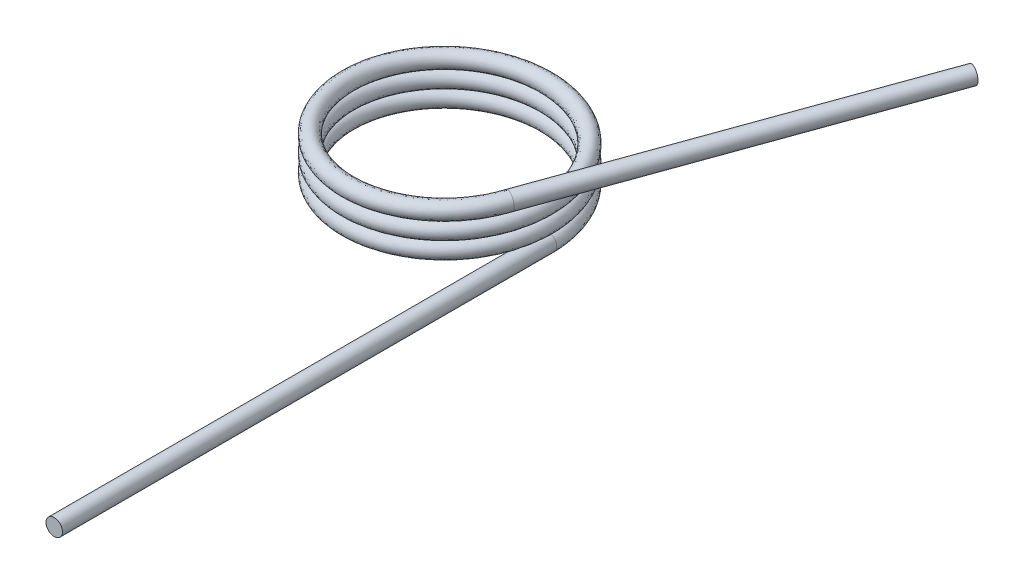
ISO-10303-21;
HEADER;
FILE_DESCRIPTION(('STEP AP214'),'2;1');
FILE_NAME('part.step','',(''),(''),'','','');
FILE_SCHEMA(('AUTOMOTIVE_DESIGN { 1 0 10303 214 1 1 1 1 }'));
ENDSEC;
DATA;
#1=APPLICATION_CONTEXT('core data for automotive mechanical design processes');
#2=APPLICATION_PROTOCOL_DEFINITION('international standard','automotive_design',2000,#1);
#3=PRODUCT_CONTEXT('',#1,'mechanical');
#4=PRODUCT('Part','Part','',(#3));
#5=PRODUCT_RELATED_PRODUCT_CATEGORY('part','',(#4));
#6=PRODUCT_DEFINITION_FORMATION('','',#4);
#7=PRODUCT_DEFINITION_CONTEXT('part definition',#1,'design');
#8=PRODUCT_DEFINITION('design','',#6,#7);
#9=PRODUCT_DEFINITION_SHAPE('','',#8);
#10=(LENGTH_UNIT() NAMED_UNIT(*) SI_UNIT(.MILLI.,.METRE.));
#11=(NAMED_UNIT(*) PLANE_ANGLE_UNIT() SI_UNIT($,.RADIAN.));
#12=(NAMED_UNIT(*) SI_UNIT($,.STERADIAN.) SOLID_ANGLE_UNIT());
#13=UNCERTAINTY_MEASURE_WITH_UNIT(LENGTH_MEASURE(1.E-05),#10,'distance_accuracy_value','');
#14=(GEOMETRIC_REPRESENTATION_CONTEXT(3) GLOBAL_UNCERTAINTY_ASSIGNED_CONTEXT((#13)) GLOBAL_UNIT_ASSIGNED_CONTEXT((#10,
#11,#12)) REPRESENTATION_CONTEXT('',''));
#15=CARTESIAN_POINT('',(0.,0.,0.));
#16=DIRECTION('',(0.,0.,1.));
#17=DIRECTION('',(1.,0.,0.));
#18=AXIS2_PLACEMENT_3D('',#15,#16,#17);
#19=CARTESIAN_POINT('',(3.25,0.,0.));
#20=CARTESIAN_POINT('',(3.25,0.0424448217317487,-1.87638837486628));
#21=CARTESIAN_POINT('',(1.625,0.0848896434634974,-2.81458256229942));
#22=CARTESIAN_POINT('',(0.,0.127334465195246,-3.75277674973257));
#23=CARTESIAN_POINT('',(-1.625,0.169779286926995,-2.81458256229943));
#24=CARTESIAN_POINT('',(-3.25,0.212224108658743,-1.87638837486628));
#25=CARTESIAN_POINT('',(-3.25,0.254668930390492,0.));
#26=CARTESIAN_POINT('',(-3.25,0.297113752122241,1.87638837486628));
#27=CARTESIAN_POINT('',(-1.625,0.339558573853989,2.81458256229942));
#28=CARTESIAN_POINT('',(0.,0.382003395585738,3.75277674973257));
#29=CARTESIAN_POINT('',(1.625,0.424448217317487,2.81458256229943));
#30=CARTESIAN_POINT('',(3.25,0.466893039049236,1.87638837486629));
#31=CARTESIAN_POINT('',(3.25,0.509337860780984,0.));
#32=CARTESIAN_POINT('',(3.25,0.551782682512733,-1.87638837486628));
#33=CARTESIAN_POINT('',(1.625,0.594227504244482,-2.81458256229942));
#34=CARTESIAN_POINT('',(0.,0.63667232597623,-3.75277674973257));
#35=CARTESIAN_POINT('',(-1.625,0.679117147707979,-2.81458256229943));
#36=CARTESIAN_POINT('',(-3.25,0.721561969439728,-1.87638837486628));
#37=CARTESIAN_POINT('',(-3.25,0.764006791171476,0.));
#38=CARTESIAN_POINT('',(-3.25,0.806451612903225,1.87638837486628));
#39=CARTESIAN_POINT('',(-1.625,0.848896434634974,2.81458256229942));
#40=CARTESIAN_POINT('',(0.,0.891341256366722,3.75277674973257));
#41=CARTESIAN_POINT('',(1.625,0.933786078098471,2.81458256229943));
#42=CARTESIAN_POINT('',(3.25,0.97623089983022,1.87638837486629));
#43=CARTESIAN_POINT('',(3.25,1.01867572156197,0.));
#44=CARTESIAN_POINT('',(3.25,1.06112054329372,-1.87638837486628));
#45=CARTESIAN_POINT('',(1.625,1.10356536502547,-2.81458256229942));
#46=CARTESIAN_POINT('',(0.,1.14601018675721,-3.75277674973257));
#47=CARTESIAN_POINT('',(-1.625,1.18845500848896,-2.81458256229943));
#48=CARTESIAN_POINT('',(-3.25,1.23089983022071,-1.87638837486628));
#49=CARTESIAN_POINT('',(-3.25,1.27334465195246,0.));
#50=CARTESIAN_POINT('',(-3.25,1.31578947368421,1.87638837486628));
#51=CARTESIAN_POINT('',(-1.625,1.35823429541596,2.81458256229942));
#52=CARTESIAN_POINT('',(0.,1.40067911714771,3.75277674973257));
#53=CARTESIAN_POINT('',(1.625,1.44312393887946,2.81458256229943));
#54=CARTESIAN_POINT('',(3.25,1.4855687606112,1.87638837486629));
#55=CARTESIAN_POINT('',(3.25,1.52801358234295,0.));
#56=CARTESIAN_POINT('',(3.25,0.499999999999999,0.));
#57=CARTESIAN_POINT('',(3.25,0.542444821731748,-1.87638837486628));
#58=CARTESIAN_POINT('',(1.625,0.584889643463496,-2.81458256229942));
#59=CARTESIAN_POINT('',(0.,0.627334465195245,-3.75277674973257));
#60=CARTESIAN_POINT('',(-1.625,0.669779286926994,-2.81458256229943));
#61=CARTESIAN_POINT('',(-3.25,0.712224108658742,-1.87638837486628));
#62=CARTESIAN_POINT('',(-3.25,0.754668930390491,0.));
#63=CARTESIAN_POINT('',(-3.25,0.79711375212224,1.87638837486628));
#64=CARTESIAN_POINT('',(-1.625,0.839558573853988,2.81458256229942));
#65=CARTESIAN_POINT('',(0.,0.882003395585737,3.75277674973257));
#66=CARTESIAN_POINT('',(1.625,0.924448217317486,2.81458256229943));
#67=CARTESIAN_POINT('',(3.25,0.966893039049235,1.87638837486628));
#68=CARTESIAN_POINT('',(3.25,1.00933786078098,0.));
#69=CARTESIAN_POINT('',(3.25,1.05178268251273,-1.87638837486628));
#70=CARTESIAN_POINT('',(1.625,1.09422750424448,-2.81458256229942));
#71=CARTESIAN_POINT('',(0.,1.13667232597623,-3.75277674973257));
#72=CARTESIAN_POINT('',(-1.625,1.17911714770798,-2.81458256229943));
#73=CARTESIAN_POINT('',(-3.25,1.22156196943973,-1.87638837486628));
#74=CARTESIAN_POINT('',(-3.25,1.26400679117147,0.));
#75=CARTESIAN_POINT('',(-3.25,1.30645161290322,1.87638837486628));
#76=CARTESIAN_POINT('',(-1.625,1.34889643463497,2.81458256229942));
#77=CARTESIAN_POINT('',(0.,1.39134125636672,3.75277674973257));
#78=CARTESIAN_POINT('',(1.625,1.43378607809847,2.81458256229943));
#79=CARTESIAN_POINT('',(3.25,1.47623089983022,1.87638837486628));
#80=CARTESIAN_POINT('',(3.25,1.51867572156197,0.));
#81=CARTESIAN_POINT('',(3.25,1.56112054329372,-1.87638837486628));
#82=CARTESIAN_POINT('',(1.625,1.60356536502546,-2.81458256229942));
#83=CARTESIAN_POINT('',(0.,1.64601018675721,-3.75277674973257));
#84=CARTESIAN_POINT('',(-1.625,1.68845500848896,-2.81458256229943));
#85=CARTESIAN_POINT('',(-3.25,1.73089983022071,-1.87638837486628));
#86=CARTESIAN_POINT('',(-3.25,1.77334465195246,0.));
#87=CARTESIAN_POINT('',(-3.25,1.81578947368421,1.87638837486628));
#88=CARTESIAN_POINT('',(-1.625,1.85823429541596,2.81458256229942));
#89=CARTESIAN_POINT('',(0.,1.90067911714771,3.75277674973257));
#90=CARTESIAN_POINT('',(1.625,1.94312393887945,2.81458256229943));
#91=CARTESIAN_POINT('',(3.25,1.9855687606112,1.87638837486628));
#92=CARTESIAN_POINT('',(3.25,2.02801358234295,0.));
#93=CARTESIAN_POINT('',(2.75,0.499999999999999,0.));
#94=CARTESIAN_POINT('',(2.75,0.542444821731748,-1.58771324027147));
#95=CARTESIAN_POINT('',(1.375,0.584889643463496,-2.38156986040721));
#96=CARTESIAN_POINT('',(0.,0.627334465195245,-3.17542648054294));
#97=CARTESIAN_POINT('',(-1.375,0.669779286926994,-2.38156986040721));
#98=CARTESIAN_POINT('',(-2.75,0.712224108658742,-1.58771324027147));
#99=CARTESIAN_POINT('',(-2.75,0.754668930390491,0.));
#100=CARTESIAN_POINT('',(-2.75,0.79711375212224,1.58771324027147));
#101=CARTESIAN_POINT('',(-1.375,0.839558573853988,2.38156986040721));
#102=CARTESIAN_POINT('',(0.,0.882003395585737,3.17542648054294));
#103=CARTESIAN_POINT('',(1.375,0.924448217317486,2.38156986040721));
#104=CARTESIAN_POINT('',(2.75,0.966893039049235,1.58771324027147));
#105=CARTESIAN_POINT('',(2.75,1.00933786078098,0.));
#106=CARTESIAN_POINT('',(2.75,1.05178268251273,-1.58771324027147));
#107=CARTESIAN_POINT('',(1.375,1.09422750424448,-2.38156986040721));
#108=CARTESIAN_POINT('',(0.,1.13667232597623,-3.17542648054294));
#109=CARTESIAN_POINT('',(-1.375,1.17911714770798,-2.38156986040721));
#110=CARTESIAN_POINT('',(-2.75,1.22156196943973,-1.58771324027147));
#111=CARTESIAN_POINT('',(-2.75,1.26400679117147,0.));
#112=CARTESIAN_POINT('',(-2.75,1.30645161290322,1.58771324027147));
#113=CARTESIAN_POINT('',(-1.375,1.34889643463497,2.38156986040721));
#114=CARTESIAN_POINT('',(0.,1.39134125636672,3.17542648054294));
#115=CARTESIAN_POINT('',(1.375,1.43378607809847,2.38156986040721));
#116=CARTESIAN_POINT('',(2.75,1.47623089983022,1.58771324027147));
#117=CARTESIAN_POINT('',(2.75,1.51867572156197,0.));
#118=CARTESIAN_POINT('',(2.75,1.56112054329372,-1.58771324027147));
#119=CARTESIAN_POINT('',(1.375,1.60356536502546,-2.38156986040721));
#120=CARTESIAN_POINT('',(0.,1.64601018675721,-3.17542648054294));
#121=CARTESIAN_POINT('',(-1.375,1.68845500848896,-2.38156986040721));
#122=CARTESIAN_POINT('',(-2.75,1.73089983022071,-1.58771324027147));
#123=CARTESIAN_POINT('',(-2.75,1.77334465195246,0.));
#124=CARTESIAN_POINT('',(-2.75,1.81578947368421,1.58771324027147));
#125=CARTESIAN_POINT('',(-1.375,1.85823429541596,2.38156986040721));
#126=CARTESIAN_POINT('',(0.,1.90067911714771,3.17542648054294));
#127=CARTESIAN_POINT('',(1.375,1.94312393887945,2.38156986040721));
#128=CARTESIAN_POINT('',(2.75,1.9855687606112,1.58771324027147));
#129=CARTESIAN_POINT('',(2.75,2.02801358234295,0.));
#130=CARTESIAN_POINT('',(2.75,0.,0.));
#131=CARTESIAN_POINT('',(2.75,0.0424448217317487,-1.58771324027147));
#132=CARTESIAN_POINT('',(1.375,0.0848896434634974,-2.38156986040721));
#133=CARTESIAN_POINT('',(0.,0.127334465195246,-3.17542648054294));
#134=CARTESIAN_POINT('',(-1.375,0.169779286926995,-2.38156986040721));
#135=CARTESIAN_POINT('',(-2.75,0.212224108658743,-1.58771324027147));
#136=CARTESIAN_POINT('',(-2.75,0.254668930390492,0.));
#137=CARTESIAN_POINT('',(-2.75,0.297113752122241,1.58771324027147));
#138=CARTESIAN_POINT('',(-1.375,0.33955857385399,2.38156986040721));
#139=CARTESIAN_POINT('',(0.,0.382003395585738,3.17542648054294));
#140=CARTESIAN_POINT('',(1.375,0.424448217317487,2.38156986040721));
#141=CARTESIAN_POINT('',(2.75,0.466893039049236,1.58771324027147));
#142=CARTESIAN_POINT('',(2.75,0.509337860780984,0.));
#143=CARTESIAN_POINT('',(2.75,0.551782682512733,-1.58771324027147));
#144=CARTESIAN_POINT('',(1.375,0.594227504244482,-2.38156986040721));
#145=CARTESIAN_POINT('',(0.,0.63667232597623,-3.17542648054294));
#146=CARTESIAN_POINT('',(-1.375,0.679117147707979,-2.38156986040721));
#147=CARTESIAN_POINT('',(-2.75,0.721561969439728,-1.58771324027147));
#148=CARTESIAN_POINT('',(-2.75,0.764006791171476,0.));
#149=CARTESIAN_POINT('',(-2.75,0.806451612903225,1.58771324027147));
#150=CARTESIAN_POINT('',(-1.375,0.848896434634974,2.38156986040721));
#151=CARTESIAN_POINT('',(0.,0.891341256366722,3.17542648054294));
#152=CARTESIAN_POINT('',(1.375,0.933786078098471,2.38156986040721));
#153=CARTESIAN_POINT('',(2.75,0.97623089983022,1.58771324027147));
#154=CARTESIAN_POINT('',(2.75,1.01867572156197,0.));
#155=CARTESIAN_POINT('',(2.75,1.06112054329372,-1.58771324027147));
#156=CARTESIAN_POINT('',(1.375,1.10356536502547,-2.38156986040721));
#157=CARTESIAN_POINT('',(0.,1.14601018675721,-3.17542648054294));
#158=CARTESIAN_POINT('',(-1.375,1.18845500848896,-2.38156986040721));
#159=CARTESIAN_POINT('',(-2.75,1.23089983022071,-1.58771324027147));
#160=CARTESIAN_POINT('',(-2.75,1.27334465195246,0.));
#161=CARTESIAN_POINT('',(-2.75,1.31578947368421,1.58771324027147));
#162=CARTESIAN_POINT('',(-1.375,1.35823429541596,2.38156986040721));
#163=CARTESIAN_POINT('',(0.,1.40067911714771,3.17542648054294));
#164=CARTESIAN_POINT('',(1.375,1.44312393887946,2.38156986040721));
#165=CARTESIAN_POINT('',(2.75,1.4855687606112,1.58771324027147));
#166=CARTESIAN_POINT('',(2.75,1.52801358234295,0.));
#167=CARTESIAN_POINT('',(2.75,-0.499999999999999,0.));
#168=CARTESIAN_POINT('',(2.75,-0.45755517826825,-1.58771324027147));
#169=CARTESIAN_POINT('',(1.375,-0.415110356536501,-2.38156986040721));
#170=CARTESIAN_POINT('',(0.,-0.372665534804753,-3.17542648054294));
#171=CARTESIAN_POINT('',(-1.375,-0.330220713073004,-2.38156986040721));
#172=CARTESIAN_POINT('',(-2.75,-0.287775891341255,-1.58771324027147));
#173=CARTESIAN_POINT('',(-2.75,-0.245331069609507,0.));
#174=CARTESIAN_POINT('',(-2.75,-0.202886247877758,1.58771324027147));
#175=CARTESIAN_POINT('',(-1.375,-0.160441426146009,2.38156986040721));
#176=CARTESIAN_POINT('',(0.,-0.117996604414261,3.17542648054294));
#177=CARTESIAN_POINT('',(1.375,-0.075551782682512,2.38156986040721));
#178=CARTESIAN_POINT('',(2.75,-0.0331069609507633,1.58771324027147));
#179=CARTESIAN_POINT('',(2.75,0.00933786078098533,0.));
#180=CARTESIAN_POINT('',(2.75,0.051782682512734,-1.58771324027147));
#181=CARTESIAN_POINT('',(1.375,0.0942275042444828,-2.38156986040721));
#182=CARTESIAN_POINT('',(0.,0.136672325976231,-3.17542648054294));
#183=CARTESIAN_POINT('',(-1.375,0.17911714770798,-2.38156986040721));
#184=CARTESIAN_POINT('',(-2.75,0.221561969439729,-1.58771324027147));
#185=CARTESIAN_POINT('',(-2.75,0.264006791171477,0.));
#186=CARTESIAN_POINT('',(-2.75,0.306451612903226,1.58771324027147));
#187=CARTESIAN_POINT('',(-1.375,0.348896434634975,2.38156986040721));
#188=CARTESIAN_POINT('',(0.,0.391341256366724,3.17542648054294));
#189=CARTESIAN_POINT('',(1.375,0.433786078098472,2.38156986040721));
#190=CARTESIAN_POINT('',(2.75,0.476230899830221,1.58771324027147));
#191=CARTESIAN_POINT('',(2.75,0.51867572156197,0.));
#192=CARTESIAN_POINT('',(2.75,0.561120543293718,-1.58771324027147));
#193=CARTESIAN_POINT('',(1.375,0.603565365025467,-2.38156986040721));
#194=CARTESIAN_POINT('',(0.,0.646010186757216,-3.17542648054294));
#195=CARTESIAN_POINT('',(-1.375,0.688455008488964,-2.38156986040721));
#196=CARTESIAN_POINT('',(-2.75,0.730899830220713,-1.58771324027147));
#197=CARTESIAN_POINT('',(-2.75,0.773344651952462,0.));
#198=CARTESIAN_POINT('',(-2.75,0.815789473684211,1.58771324027147));
#199=CARTESIAN_POINT('',(-1.375,0.858234295415959,2.38156986040721));
#200=CARTESIAN_POINT('',(0.,0.900679117147708,3.17542648054294));
#201=CARTESIAN_POINT('',(1.375,0.943123938879456,2.38156986040721));
#202=CARTESIAN_POINT('',(2.75,0.985568760611205,1.58771324027147));
#203=CARTESIAN_POINT('',(2.75,1.02801358234295,0.));
#204=CARTESIAN_POINT('',(3.25,-0.499999999999999,0.));
#205=CARTESIAN_POINT('',(3.25,-0.45755517826825,-1.87638837486628));
#206=CARTESIAN_POINT('',(1.625,-0.415110356536501,-2.81458256229942));
#207=CARTESIAN_POINT('',(0.,-0.372665534804753,-3.75277674973257));
#208=CARTESIAN_POINT('',(-1.625,-0.330220713073004,-2.81458256229943));
#209=CARTESIAN_POINT('',(-3.25,-0.287775891341255,-1.87638837486628));
#210=CARTESIAN_POINT('',(-3.25,-0.245331069609507,0.));
#211=CARTESIAN_POINT('',(-3.25,-0.202886247877758,1.87638837486628));
#212=CARTESIAN_POINT('',(-1.625,-0.160441426146009,2.81458256229942));
#213=CARTESIAN_POINT('',(0.,-0.117996604414261,3.75277674973257));
#214=CARTESIAN_POINT('',(1.625,-0.075551782682512,2.81458256229943));
#215=CARTESIAN_POINT('',(3.25,-0.0331069609507633,1.87638837486628));
#216=CARTESIAN_POINT('',(3.25,0.00933786078098533,0.));
#217=CARTESIAN_POINT('',(3.25,0.051782682512734,-1.87638837486628));
#218=CARTESIAN_POINT('',(1.625,0.0942275042444828,-2.81458256229942));
#219=CARTESIAN_POINT('',(0.,0.136672325976231,-3.75277674973257));
#220=CARTESIAN_POINT('',(-1.625,0.17911714770798,-2.81458256229943));
#221=CARTESIAN_POINT('',(-3.25,0.221561969439729,-1.87638837486628));
#222=CARTESIAN_POINT('',(-3.25,0.264006791171477,0.));
#223=CARTESIAN_POINT('',(-3.25,0.306451612903226,1.87638837486628));
#224=CARTESIAN_POINT('',(-1.625,0.348896434634975,2.81458256229942));
#225=CARTESIAN_POINT('',(0.,0.391341256366724,3.75277674973257));
#226=CARTESIAN_POINT('',(1.625,0.433786078098472,2.81458256229943));
#227=CARTESIAN_POINT('',(3.25,0.476230899830221,1.87638837486628));
#228=CARTESIAN_POINT('',(3.25,0.51867572156197,0.));
#229=CARTESIAN_POINT('',(3.25,0.561120543293718,-1.87638837486628));
#230=CARTESIAN_POINT('',(1.625,0.603565365025467,-2.81458256229942));
#231=CARTESIAN_POINT('',(0.,0.646010186757216,-3.75277674973257));
#232=CARTESIAN_POINT('',(-1.625,0.688455008488964,-2.81458256229943));
#233=CARTESIAN_POINT('',(-3.25,0.730899830220713,-1.87638837486628));
#234=CARTESIAN_POINT('',(-3.25,0.773344651952462,0.));
#235=CARTESIAN_POINT('',(-3.25,0.815789473684211,1.87638837486628));
#236=CARTESIAN_POINT('',(-1.625,0.858234295415959,2.81458256229942));
#237=CARTESIAN_POINT('',(0.,0.900679117147708,3.75277674973257));
#238=CARTESIAN_POINT('',(1.625,0.943123938879456,2.81458256229943));
#239=CARTESIAN_POINT('',(3.25,0.985568760611205,1.87638837486628));
#240=CARTESIAN_POINT('',(3.25,1.02801358234295,0.));
#241=CARTESIAN_POINT('',(3.25,0.,0.));
#242=CARTESIAN_POINT('',(3.25,0.0424448217317487,-1.87638837486628));
#243=CARTESIAN_POINT('',(1.625,0.0848896434634974,-2.81458256229942));
#244=CARTESIAN_POINT('',(0.,0.127334465195246,-3.75277674973257));
#245=CARTESIAN_POINT('',(-1.625,0.169779286926995,-2.81458256229943));
#246=CARTESIAN_POINT('',(-3.25,0.212224108658743,-1.87638837486628));
#247=CARTESIAN_POINT('',(-3.25,0.254668930390492,0.));
#248=CARTESIAN_POINT('',(-3.25,0.297113752122241,1.87638837486628));
#249=CARTESIAN_POINT('',(-1.625,0.339558573853989,2.81458256229942));
#250=CARTESIAN_POINT('',(0.,0.382003395585738,3.75277674973257));
#251=CARTESIAN_POINT('',(1.625,0.424448217317487,2.81458256229943));
#252=CARTESIAN_POINT('',(3.25,0.466893039049236,1.87638837486629));
#253=CARTESIAN_POINT('',(3.25,0.509337860780984,0.));
#254=CARTESIAN_POINT('',(3.25,0.551782682512733,-1.87638837486628));
#255=CARTESIAN_POINT('',(1.625,0.594227504244482,-2.81458256229942));
#256=CARTESIAN_POINT('',(0.,0.63667232597623,-3.75277674973257));
#257=CARTESIAN_POINT('',(-1.625,0.679117147707979,-2.81458256229943));
#258=CARTESIAN_POINT('',(-3.25,0.721561969439728,-1.87638837486628));
#259=CARTESIAN_POINT('',(-3.25,0.764006791171476,0.));
#260=CARTESIAN_POINT('',(-3.25,0.806451612903225,1.87638837486628));
#261=CARTESIAN_POINT('',(-1.625,0.848896434634974,2.81458256229942));
#262=CARTESIAN_POINT('',(0.,0.891341256366722,3.75277674973257));
#263=CARTESIAN_POINT('',(1.625,0.933786078098471,2.81458256229943));
#264=CARTESIAN_POINT('',(3.25,0.97623089983022,1.87638837486629));
#265=CARTESIAN_POINT('',(3.25,1.01867572156197,0.));
#266=CARTESIAN_POINT('',(3.25,1.06112054329372,-1.87638837486628));
#267=CARTESIAN_POINT('',(1.625,1.10356536502547,-2.81458256229942));
#268=CARTESIAN_POINT('',(0.,1.14601018675721,-3.75277674973257));
#269=CARTESIAN_POINT('',(-1.625,1.18845500848896,-2.81458256229943));
#270=CARTESIAN_POINT('',(-3.25,1.23089983022071,-1.87638837486628));
#271=CARTESIAN_POINT('',(-3.25,1.27334465195246,0.));
#272=CARTESIAN_POINT('',(-3.25,1.31578947368421,1.87638837486628));
#273=CARTESIAN_POINT('',(-1.625,1.35823429541596,2.81458256229942));
#274=CARTESIAN_POINT('',(0.,1.40067911714771,3.75277674973257));
#275=CARTESIAN_POINT('',(1.625,1.44312393887946,2.81458256229943));
#276=CARTESIAN_POINT('',(3.25,1.4855687606112,1.87638837486629));
#277=CARTESIAN_POINT('',(3.25,1.52801358234295,0.));
#278=(BOUNDED_SURFACE() B_SPLINE_SURFACE(3,2,((#19,#20,#21,#22,#23,#24,#25,#26,#27,#28,#29,#30,
#31,#32,#33,#34,#35,#36,#37,#38,#39,#40,#41,#42,#43,#44,#45,#46,#47,#48,#49,#50,#51,#52,#53,#54,
#55),(#56,#57,#58,#59,#60,#61,#62,#63,#64,#65,#66,#67,#68,#69,#70,#71,#72,#73,#74,#75,#76,#77,
#78,#79,#80,#81,#82,#83,#84,#85,#86,#87,#88,#89,#90,#91,#92),(#93,#94,#95,#96,#97,#98,#99,#100,
#101,#102,#103,#104,#105,#106,#107,#108,#109,#110,#111,#112,#113,#114,#115,#116,#117,#118,#119,
#120,#121,#122,#123,#124,#125,#126,#127,#128,#129),(#130,#131,#132,#133,#134,#135,#136,#137,
#138,#139,#140,#141,#142,#143,#144,#145,#146,#147,#148,#149,#150,#151,#152,#153,#154,#155,#156,
#157,#158,#159,#160,#161,#162,#163,#164,#165,#166),(#167,#168,#169,#170,#171,#172,#173,#174,
#175,#176,#177,#178,#179,#180,#181,#182,#183,#184,#185,#186,#187,#188,#189,#190,#191,#192,#193,
#194,#195,#196,#197,#198,#199,#200,#201,#202,#203),(#204,#205,#206,#207,#208,#209,#210,#211,
#212,#213,#214,#215,#216,#217,#218,#219,#220,#221,#222,#223,#224,#225,#226,#227,#228,#229,#230,
#231,#232,#233,#234,#235,#236,#237,#238,#239,#240),(#241,#242,#243,#244,#245,#246,#247,#248,
#249,#250,#251,#252,#253,#254,#255,#256,#257,#258,#259,#260,#261,#262,#263,#264,#265,#266,#267,
#268,#269,#270,#271,#272,#273,#274,#275,#276,#277)),.UNSPECIFIED.,.T.,.F.,
.F.) B_SPLINE_SURFACE_WITH_KNOTS((4,3,4),(3,2,2,2,2,2,2,2,2,2,2,2,2,2,2,2,2,2,3),(0.,0.5,1.),
(0.,0.0555555555555556,0.111111111111111,0.166666666666667,0.222222222222222,0.277777777777778,
0.333333333333333,0.388888888888889,0.444444444444444,0.5,0.555555555555556,0.611111111111111,
0.666666666666667,0.722222222222222,0.777777777777778,0.833333333333333,0.888888888888889,
0.944444444444444,1.),
.UNSPECIFIED.) GEOMETRIC_REPRESENTATION_ITEM() RATIONAL_B_SPLINE_SURFACE(((1.,0.866025403784439,
1.,0.866025403784439,1.,0.866025403784439,1.,0.866025403784439,1.,0.866025403784439,1.,
0.866025403784439,1.,0.866025403784439,1.,0.866025403784439,1.,0.866025403784439,1.,
0.866025403784439,1.,0.866025403784439,1.,0.866025403784439,1.,0.866025403784439,1.,
0.866025403784439,1.,0.866025403784439,1.,0.866025403784439,1.,0.866025403784439,1.,
0.866025403784439,1.),(0.333333333333333,0.288675134594813,0.333333333333333,0.288675134594813,
0.333333333333333,0.288675134594813,0.333333333333333,0.288675134594813,0.333333333333333,
0.288675134594813,0.333333333333333,0.288675134594813,0.333333333333333,0.288675134594813,
0.333333333333333,0.288675134594813,0.333333333333333,0.288675134594813,0.333333333333333,
0.288675134594813,0.333333333333333,0.288675134594813,0.333333333333333,0.288675134594813,
0.333333333333333,0.288675134594813,0.333333333333333,0.288675134594813,0.333333333333333,
0.288675134594813,0.333333333333333,0.288675134594813,0.333333333333333,0.288675134594813,
0.333333333333333,0.288675134594813,0.333333333333333),(0.333333333333333,0.288675134594813,
0.333333333333333,0.288675134594813,0.333333333333333,0.288675134594813,0.333333333333333,
0.288675134594813,0.333333333333333,0.288675134594813,0.333333333333333,0.288675134594813,
0.333333333333333,0.288675134594813,0.333333333333333,0.288675134594813,0.333333333333333,
0.288675134594813,0.333333333333333,0.288675134594813,0.333333333333333,0.288675134594813,
0.333333333333333,0.288675134594813,0.333333333333333,0.288675134594813,0.333333333333333,
0.288675134594813,0.333333333333333,0.288675134594813,0.333333333333333,0.288675134594813,
0.333333333333333,0.288675134594813,0.333333333333333,0.288675134594813,0.333333333333333),(1.,
0.866025403784439,1.,0.866025403784439,1.,0.866025403784439,1.,0.866025403784439,1.,
0.866025403784439,1.,0.866025403784439,1.,0.866025403784439,1.,0.866025403784439,1.,
0.866025403784439,1.,0.866025403784439,1.,0.866025403784439,1.,0.866025403784439,1.,
0.866025403784439,1.,0.866025403784439,1.,0.866025403784439,1.,0.866025403784439,1.,
0.866025403784439,1.,0.866025403784439,1.),(0.333333333333333,0.288675134594813,
0.333333333333333,0.288675134594813,0.333333333333333,0.288675134594813,0.333333333333333,
0.288675134594813,0.333333333333333,0.288675134594813,0.333333333333333,0.288675134594813,
0.333333333333333,0.288675134594813,0.333333333333333,0.288675134594813,0.333333333333333,
0.288675134594813,0.333333333333333,0.288675134594813,0.333333333333333,0.288675134594813,
0.333333333333333,0.288675134594813,0.333333333333333,0.288675134594813,0.333333333333333,
0.288675134594813,0.333333333333333,0.288675134594813,0.333333333333333,0.288675134594813,
0.333333333333333,0.288675134594813,0.333333333333333,0.288675134594813,0.333333333333333),
(0.333333333333333,0.288675134594813,0.333333333333333,0.288675134594813,0.333333333333333,
0.288675134594813,0.333333333333333,0.288675134594813,0.333333333333333,0.288675134594813,
0.333333333333333,0.288675134594813,0.333333333333333,0.288675134594813,0.333333333333333,
0.288675134594813,0.333333333333333,0.288675134594813,0.333333333333333,0.288675134594813,
0.333333333333333,0.288675134594813,0.333333333333333,0.288675134594813,0.333333333333333,
0.288675134594813,0.333333333333333,0.288675134594813,0.333333333333333,0.288675134594813,
0.333333333333333,0.288675134594813,0.333333333333333,0.288675134594813,0.333333333333333,
0.288675134594813,0.333333333333333),(1.,0.866025403784439,1.,0.866025403784439,1.,
0.866025403784439,1.,0.866025403784439,1.,0.866025403784439,1.,0.866025403784439,1.,
0.866025403784439,1.,0.866025403784439,1.,0.866025403784439,1.,0.866025403784439,1.,
0.866025403784439,1.,0.866025403784439,1.,0.866025403784439,1.,0.866025403784439,1.,
0.866025403784439,1.,0.866025403784439,1.,0.866025403784439,1.,0.866025403784439,1.))) REPRESENTATION_ITEM('') SURFACE());
#279=CARTESIAN_POINT('',(2.82264230686272,1.5,1.01621376073577));
#280=DIRECTION('',(-0.338737920245255,0.,0.940880768954239));
#281=DIRECTION('',(0.940880768954239,0.,0.338737920245255));
#282=AXIS2_PLACEMENT_3D('',#279,#280,#281);
#283=CIRCLE('',#282,0.249999999999999);
#284=CARTESIAN_POINT('',(3.05786249910127,1.5,1.10089824079708));
#285=VERTEX_POINT('',#284);
#286=EDGE_CURVE('E88',#285,#285,#283,.T.);
#287=CARTESIAN_POINT('',(3.,0.,0.));
#288=DIRECTION('',(0.,0.,1.));
#289=DIRECTION('',(1.,0.,0.));
#290=AXIS2_PLACEMENT_3D('',#287,#288,#289);
#291=CIRCLE('',#290,0.249999999999999);
#292=CARTESIAN_POINT('',(3.25,0.,0.));
#293=VERTEX_POINT('',#292);
#294=EDGE_CURVE('E39',#293,#293,#291,.T.);
#295=CARTESIAN_POINT('',(2.95719948805285,1.25004282332481,0.656126562873237));
#296=CARTESIAN_POINT('',(2.96257246818101,1.25006278035191,0.644402317034474));
#297=CARTESIAN_POINT('',(2.96755845184823,1.25008057002458,0.632501436246161));
#298=CARTESIAN_POINT('',(2.97708268270714,1.25010387752033,0.60852102519398));
#299=CARTESIAN_POINT('',(2.98162071544694,1.25010938949255,0.5964414125156));
#300=CARTESIAN_POINT('',(2.99472054282955,1.25010797297463,0.559983492932918));
#301=CARTESIAN_POINT('',(3.00275598464324,1.25008303602616,0.535414475674389));
#302=CARTESIAN_POINT('',(3.01765456277391,1.25002583274865,0.485861536040892));
#303=CARTESIAN_POINT('',(3.02451468118795,1.24999354803271,0.460876721091404));
#304=CARTESIAN_POINT('',(3.03692341761693,1.25000936535919,0.410602325488502));
#305=CARTESIAN_POINT('',(3.04247348399819,1.25005737814682,0.38531311420152));
#306=CARTESIAN_POINT('',(3.049440556029,1.25034094648257,0.347263687390478));
#307=CARTESIAN_POINT('',(3.05152944088001,1.25046956277863,0.334624921636813));
#308=CARTESIAN_POINT('',(3.05512910648929,1.25084609841043,0.309277737919677));
#309=CARTESIAN_POINT('',(3.05664066315507,1.2510938566044,0.296569436889249));
#310=CARTESIAN_POINT('',(3.05820666256281,1.25163726648319,0.277442403803942));
#311=CARTESIAN_POINT('',(3.05861181799538,1.25184728135396,0.271050551423989));
#312=CARTESIAN_POINT('',(3.05907800594856,1.25235464705332,0.258259382499722));
#313=CARTESIAN_POINT('',(3.05913935926677,1.25265191619327,0.251860078488233));
#314=CARTESIAN_POINT('',(3.05874951391235,1.2532202841033,0.242270479276295));
#315=CARTESIAN_POINT('',(3.05853859367808,1.25343054615142,0.239070859047116));
#316=CARTESIAN_POINT('',(3.05784912690529,1.25391630842304,0.232710001452684));
#317=CARTESIAN_POINT('',(3.05737056129531,1.25419181329472,0.229548766839058));
#318=CARTESIAN_POINT('',(3.05604879856996,1.2547923259318,0.224025719544655));
#319=CARTESIAN_POINT('',(3.05531465021689,1.25509141378083,0.221647120793136));
#320=CARTESIAN_POINT('',(3.05375666318798,1.25561010151491,0.218785291004204));
#321=CARTESIAN_POINT('',(3.0533177494091,1.25575011101647,0.218094256761962));
#322=CARTESIAN_POINT('',(3.05227017690161,1.25606278037805,0.216833349124598));
#323=CARTESIAN_POINT('',(3.05166013286346,1.25623570283451,0.21626453441151));
#324=CARTESIAN_POINT('',(3.05046621742817,1.25654962459833,0.215571626404985));
#325=CARTESIAN_POINT('',(3.0499323073821,1.25668401982744,0.215364478265397));
#326=CARTESIAN_POINT('',(3.04882463224368,1.25694923116607,0.215157201793815));
#327=CARTESIAN_POINT('',(3.04825082678864,1.25708004345862,0.215157286261284));
#328=CARTESIAN_POINT('',(3.04692332434054,1.25736976507587,0.21535834844449));
#329=CARTESIAN_POINT('',(3.04618191226996,1.25752108049585,0.215633883099501));
#330=CARTESIAN_POINT('',(3.04421301597778,1.25790462977525,0.216632319388296));
#331=CARTESIAN_POINT('',(3.04308498555229,1.25810158513191,0.217536795362447));
#332=CARTESIAN_POINT('',(3.04031255251925,1.2585560716865,0.220154295234473));
#333=CARTESIAN_POINT('',(3.03881413030492,1.25876872975867,0.222008776964774));
#334=CARTESIAN_POINT('',(3.03602261701095,1.25913059055458,0.225881316736244));
#335=CARTESIAN_POINT('',(3.03473099419376,1.25927935114805,0.227900403014251));
#336=CARTESIAN_POINT('',(3.03063715361451,1.25971043040105,0.234761364650399));
#337=CARTESIAN_POINT('',(3.02811910561222,1.25990608046595,0.239774719156334));
#338=CARTESIAN_POINT('',(3.02339050245825,1.26019995503593,0.249948868911135));
#339=CARTESIAN_POINT('',(3.02118071473406,1.26029793999533,0.255109994895786));
#340=CARTESIAN_POINT('',(3.01696475421629,1.26042929006453,0.265514799817989));
#341=CARTESIAN_POINT('',(3.01495851643965,1.26046267585943,0.270758451787779));
#342=CARTESIAN_POINT('',(3.01109020472544,1.26048433821113,0.281289791737163));
#343=CARTESIAN_POINT('',(3.0092279448374,1.26047267397837,0.286577412806788));
#344=CARTESIAN_POINT('',(3.000225792123,1.26033646133041,0.31292744419421));
#345=CARTESIAN_POINT('',(2.99382369583672,1.25997964494096,0.334238434232485));
#346=CARTESIAN_POINT('',(2.98175986321093,1.25908103838331,0.377078461899071));
#347=CARTESIAN_POINT('',(2.97609902052949,1.25853902773322,0.398607729614206));
#348=CARTESIAN_POINT('',(2.9653050142324,1.2573830332176,0.44178571822131));
#349=CARTESIAN_POINT('',(2.96017157923362,1.25676908671906,0.463434371578056));
#350=CARTESIAN_POINT('',(2.95034642466894,1.25553550744262,0.506831262113753));
#351=CARTESIAN_POINT('',(2.94565471826024,1.25491587449594,0.528579502238745));
#352=CARTESIAN_POINT('',(2.93788537393497,1.25385313166345,0.56682705740363));
#353=CARTESIAN_POINT('',(2.93469444338632,1.25340406613074,0.583302710010566));
#354=CARTESIAN_POINT('',(2.93028029111629,1.25274647613167,0.608061839234225));
#355=CARTESIAN_POINT('',(2.9288724538719,1.25253020414566,0.61631229830193));
#356=CARTESIAN_POINT('',(2.92623641976894,1.25210232576767,0.632841631233407));
#357=CARTESIAN_POINT('',(2.92500817648997,1.25189071818212,0.641120497186494));
#358=CARTESIAN_POINT('',(2.92325970632105,1.25154423692668,0.654764115347366));
#359=CARTESIAN_POINT('',(2.92264309079082,1.25140886541579,0.660117015976407));
#360=CARTESIAN_POINT('',(2.92162197661367,1.2511362578803,0.670877744746427));
#361=CARTESIAN_POINT('',(2.9212185881135,1.25099901584085,0.676285713790247));
#362=CARTESIAN_POINT('',(2.9210296706166,1.25078552197881,0.684423791245345));
#363=CARTESIAN_POINT('',(2.92103678128294,1.25071283190231,0.687149914013246));
#364=CARTESIAN_POINT('',(2.92129659942559,1.25056275613224,0.692584397845834));
#365=CARTESIAN_POINT('',(2.92154749318813,1.25048540907065,0.695292741440021));
#366=CARTESIAN_POINT('',(2.92254445616439,1.25036182097179,0.698989165765149));
#367=CARTESIAN_POINT('',(2.92290805268572,1.25032437954414,0.700043832240259));
#368=CARTESIAN_POINT('',(2.92370245985595,1.25026777508806,0.70134506308441));
#369=CARTESIAN_POINT('',(2.92395502544515,1.25025149906163,0.701690290792377));
#370=CARTESIAN_POINT('',(2.92456073442935,1.25021787910919,0.702297617508312));
#371=CARTESIAN_POINT('',(2.92491486015699,1.25020052611772,0.702558848999307));
#372=CARTESIAN_POINT('',(2.9256656272527,1.25016920184373,0.702883179074349));
#373=CARTESIAN_POINT('',(2.92605449355096,1.25015506590672,0.702963455767722));
#374=CARTESIAN_POINT('',(2.92686507783848,1.25012908510803,0.702979169929514));
#375=CARTESIAN_POINT('',(2.92728656077014,1.25011756635258,0.702900743946707));
#376=CARTESIAN_POINT('',(2.928382335525,1.25009068560444,0.702557720321435));
#377=CARTESIAN_POINT('',(2.92902189978703,1.25007846485311,0.702200100450598));
#378=CARTESIAN_POINT('',(2.93056028760823,1.25005288531693,0.701154335547647));
#379=CARTESIAN_POINT('',(2.93140220711238,1.25004276338902,0.700393481987741));
#380=CARTESIAN_POINT('',(2.93299420397175,1.25002697255737,0.698775816540065));
#381=CARTESIAN_POINT('',(2.93374357955959,1.25002133610114,0.697918355764541));
#382=CARTESIAN_POINT('',(2.93611042847763,1.25000675247825,0.695020790815896));
#383=CARTESIAN_POINT('',(2.93760254275892,1.25000289481336,0.692880208080286));
#384=CARTESIAN_POINT('',(2.94044563278504,1.24999944473998,0.688506431128742));
#385=CARTESIAN_POINT('',(2.94179624620739,1.24999986302309,0.686273018679844));
#386=CARTESIAN_POINT('',(2.94570793410017,1.2500041954285,0.679501445498426));
#387=CARTESIAN_POINT('',(2.94813382663249,1.25001117820886,0.674884743315495));
#388=CARTESIAN_POINT('',(2.95163099327648,1.2500226171473,0.667893218090052));
#389=CARTESIAN_POINT('',(2.95277307835152,1.25002659081697,0.665551686695597));
#390=CARTESIAN_POINT('',(2.95501516264925,1.25003468029146,0.660851341548871));
#391=CARTESIAN_POINT('',(2.95611520544709,1.25003879594022,0.65849254888572));
#392=CARTESIAN_POINT('',(2.95719948805285,1.25004282332481,0.656126562873237));
#393=B_SPLINE_CURVE_WITH_KNOTS('',3,(#295,#296,#297,#298,#299,#300,#301,#302,#303,#304,#305,
#306,#307,#308,#309,#310,#311,#312,#313,#314,#315,#316,#317,#318,#319,#320,#321,#322,#323,#324,
#325,#326,#327,#328,#329,#330,#331,#332,#333,#334,#335,#336,#337,#338,#339,#340,#341,#342,#343,
#344,#345,#346,#347,#348,#349,#350,#351,#352,#353,#354,#355,#356,#357,#358,#359,#360,#361,#362,
#363,#364,#365,#366,#367,#368,#369,#370,#371,#372,#373,#374,#375,#376,#377,#378,#379,#380,#381,
#382,#383,#384,#385,#386,#387,#388,#389,#390,#391,#392),.UNSPECIFIED.,.T.,.F.,(4,2,2,2,2,2,2,2,
2,2,2,2,2,2,2,2,2,2,2,2,2,2,2,2,2,2,2,2,2,2,2,2,2,2,2,2,2,2,2,2,2,2,2,2,2,2,2,2,4),(0.,
0.0386893223336779,0.0773970778537374,0.154904955981235,0.232608963289237,0.310226656013498,
0.348652117403038,0.387025753151803,0.406244974796267,0.425446260226508,0.435074951565272,
0.444704329098081,0.452121133792266,0.454601437375427,0.45710242921899,0.458832034006539,
0.460563414861708,0.462937458463574,0.467256614656679,0.474405945144414,0.481603977344994,
0.498407115356868,0.515251366176347,0.532090222457265,0.548906954524267,0.615627359263124,
0.682427475954235,0.749193045957298,0.815960603989621,0.866318280469179,0.891435307080674,
0.91654583006977,0.932716621723454,0.948970795884607,0.957152280923939,0.965273359230851,
0.968572420155606,0.969846492568094,0.971133329861799,0.972291685070124,0.973555583614907,
0.975723217682145,0.97911191136354,0.98252490122912,0.990334775446204,0.998164182253961,
1.01379681212243,1.02161276060053,1.02942037541285),.UNSPECIFIED.);
#394=CARTESIAN_POINT('',(2.95719948805285,1.25004282332481,0.656126562873237));
#395=VERTEX_POINT('',#394);
#396=EDGE_CURVE('E43',#395,#395,#393,.T.);
#397=CARTESIAN_POINT('',(2.94547115009101,0.243980746223176,0.796248661796764));
#398=CARTESIAN_POINT('',(2.94480058994518,0.243830973529698,0.795915196011656));
#399=CARTESIAN_POINT('',(2.94422972249077,0.243700502382653,0.795400908471127));
#400=CARTESIAN_POINT('',(2.94290615478585,0.24339477186198,0.793874063151036));
#401=CARTESIAN_POINT('',(2.94228899150236,0.243248318762008,0.792758890047495));
#402=CARTESIAN_POINT('',(2.94061404320993,0.242847023615582,0.789120466166746));
#403=CARTESIAN_POINT('',(2.9398763699694,0.242663699311114,0.786465348022509));
#404=CARTESIAN_POINT('',(2.93867353953789,0.242361941916147,0.781081490475045));
#405=CARTESIAN_POINT('',(2.9382112688469,0.242244196970248,0.778352274367238));
#406=CARTESIAN_POINT('',(2.93707913426773,0.241953873533289,0.770222246760278));
#407=CARTESIAN_POINT('',(2.93663975433453,0.241838111667151,0.764786124250915));
#408=CARTESIAN_POINT('',(2.93603930391088,0.24167959992834,0.753896440382052));
#409=CARTESIAN_POINT('',(2.93587875931506,0.241636988021178,0.748442865463038));
#410=CARTESIAN_POINT('',(2.93566741322872,0.241581072907361,0.732132844871296));
#411=CARTESIAN_POINT('',(2.93588257703208,0.24163854123225,0.721272225694097));
#412=CARTESIAN_POINT('',(2.93706725454863,0.241950435627602,0.688776476272851));
#413=CARTESIAN_POINT('',(2.93857420065081,0.24234390710571,0.667168734073156));
#414=CARTESIAN_POINT('',(2.94233687676162,0.243266871851563,0.624002131732959));
#415=CARTESIAN_POINT('',(2.94459348523403,0.243796524532778,0.602443358957801));
#416=CARTESIAN_POINT('',(2.94969797873885,0.24490144645314,0.559379275017253));
#417=CARTESIAN_POINT('',(2.95254630538615,0.245476749563074,0.537874015991245));
#418=CARTESIAN_POINT('',(2.95734486228848,0.246339438342135,0.505704594198238));
#419=CARTESIAN_POINT('',(2.95903125035371,0.246626837753984,0.495000621306199));
#420=CARTESIAN_POINT('',(2.96264359750545,0.247200227622066,0.473633438845387));
#421=CARTESIAN_POINT('',(2.96456950806769,0.247486218351515,0.462970221469766));
#422=CARTESIAN_POINT('',(2.96777526439033,0.24791667942465,0.447056973854937));
#423=CARTESIAN_POINT('',(2.96889463272619,0.248060182711559,0.441774497510303));
#424=CARTESIAN_POINT('',(2.97129571666916,0.248349734215539,0.431247273478161));
#425=CARTESIAN_POINT('',(2.9725773426676,0.248495780989834,0.426002506641926));
#426=CARTESIAN_POINT('',(2.97474111693997,0.248721709493763,0.418197138955134));
#427=CARTESIAN_POINT('',(2.97550350632552,0.24879824431075,0.41560301062924));
#428=CARTESIAN_POINT('',(2.97715517331759,0.24895550930193,0.410456494748791));
#429=CARTESIAN_POINT('',(2.97804423143248,0.24903623206851,0.407904043331067));
#430=CARTESIAN_POINT('',(2.9795864521257,0.249165677754058,0.404149748156156));
#431=CARTESIAN_POINT('',(2.98013803351961,0.249210423710986,0.402905696123367));
#432=CARTESIAN_POINT('',(2.98135347413324,0.249304466228656,0.400476280678481));
#433=CARTESIAN_POINT('',(2.98201656724698,0.24935373076132,0.399290583742916));
#434=CARTESIAN_POINT('',(2.98321919335845,0.249436455855054,0.397657827226665));
#435=CARTESIAN_POINT('',(2.98365412537538,0.249465464566592,0.397138377600646));
#436=CARTESIAN_POINT('',(2.98450441602105,0.249519624557203,0.396338430572853));
#437=CARTESIAN_POINT('',(2.98489296542122,0.249543681339532,0.396031360135681));
#438=CARTESIAN_POINT('',(2.98590767455131,0.249602967611977,0.395558918278782));
#439=CARTESIAN_POINT('',(2.9865687394745,0.249639490231034,0.395446777776394));
#440=CARTESIAN_POINT('',(2.98786325466792,0.249706399819713,0.395730882783247));
#441=CARTESIAN_POINT('',(2.98846915857993,0.24973441523284,0.396224638775756));
#442=CARTESIAN_POINT('',(2.98979881285602,0.249793204636653,0.397673127257718));
#443=CARTESIAN_POINT('',(2.99035273262397,0.249814416308289,0.398721396398088));
#444=CARTESIAN_POINT('',(2.9917684648772,0.249865887197724,0.401876323450042));
#445=CARTESIAN_POINT('',(2.99244337704906,0.249886460803551,0.404067822696706));
#446=CARTESIAN_POINT('',(2.99358961326912,0.249918423418814,0.408508489567653));
#447=CARTESIAN_POINT('',(2.99405897866,0.249929724926034,0.41075800450364));
#448=CARTESIAN_POINT('',(2.99529269616088,0.249957056392858,0.417481857510135));
#449=CARTESIAN_POINT('',(2.99589855407536,0.249966955448745,0.421987246533557));
#450=CARTESIAN_POINT('',(2.9969070549818,0.249981282482184,0.431021163056777));
#451=CARTESIAN_POINT('',(2.99730941571773,0.249985702872933,0.435549713942337));
#452=CARTESIAN_POINT('',(2.99831346736183,0.24999529157857,0.449115027731651));
#453=CARTESIAN_POINT('',(2.99871686020968,0.249996850750032,0.45816691868634));
#454=CARTESIAN_POINT('',(2.99947509854657,0.249999928162024,0.485356727176243));
#455=CARTESIAN_POINT('',(2.99937564791318,0.249999837597782,0.503503905661963));
#456=CARTESIAN_POINT('',(2.99838145181189,0.249995131669361,0.539788089019681));
#457=CARTESIAN_POINT('',(2.99748602229832,0.249990512412978,0.557925071712093));
#458=CARTESIAN_POINT('',(2.99495872018363,0.249952402431275,0.594148397272658));
#459=CARTESIAN_POINT('',(2.99332683413799,0.249918911178865,0.612234739210262));
#460=CARTESIAN_POINT('',(2.98927402762284,0.249778267070544,0.648317856419838));
#461=CARTESIAN_POINT('',(2.98685323432449,0.24967112608382,0.666314645653232));
#462=CARTESIAN_POINT('',(2.98175060645595,0.249342701275536,0.697563312080151));
#463=CARTESIAN_POINT('',(2.97929396849237,0.249157628174341,0.710851280054149));
#464=CARTESIAN_POINT('',(2.97456063949783,0.248709414561653,0.732656927990863));
#465=CARTESIAN_POINT('',(2.97251889932059,0.248495863215733,0.741225255632414));
#466=CARTESIAN_POINT('',(2.96868189440963,0.248035374219498,0.755316973908056));
#467=CARTESIAN_POINT('',(2.96704009314904,0.24782466826108,0.760882119861412));
#468=CARTESIAN_POINT('',(2.96398452343634,0.2473952560245,0.770050592964977));
#469=CARTESIAN_POINT('',(2.96267706796961,0.24720261142447,0.773689708753699));
#470=CARTESIAN_POINT('',(2.9602495669786,0.246821589330023,0.779694061063162));
#471=CARTESIAN_POINT('',(2.95920591085199,0.246652026545107,0.782090246652587));
#472=CARTESIAN_POINT('',(2.95726094420397,0.246320949737284,0.786041908282106));
#473=CARTESIAN_POINT('',(2.95641690518783,0.246173447645337,0.787626316048154));
#474=CARTESIAN_POINT('',(2.95459801376104,0.245844493016377,0.790636713533128));
#475=CARTESIAN_POINT('',(2.9536295421527,0.245664587810176,0.792066470837527));
#476=CARTESIAN_POINT('',(2.95181286087888,0.245313061992644,0.794168133505149));
#477=CARTESIAN_POINT('',(2.95106231212146,0.245165003638977,0.794919660793184));
#478=CARTESIAN_POINT('',(2.94970684109199,0.244889465247543,0.795886467679697));
#479=CARTESIAN_POINT('',(2.94917135097868,0.244779073975353,0.79619474657798));
#480=CARTESIAN_POINT('',(2.9481547916242,0.244565485895929,0.796560523048076));
#481=CARTESIAN_POINT('',(2.94768987258577,0.244466551150081,0.796659583301029));
#482=CARTESIAN_POINT('',(2.94661990987866,0.24423539092968,0.796669502669376));
#483=CARTESIAN_POINT('',(2.94601298448219,0.244101767427151,0.796518112988842));
#484=CARTESIAN_POINT('',(2.94547115009101,0.243980746223176,0.796248661796764));
#485=B_SPLINE_CURVE_WITH_KNOTS('',3,(#397,#398,#399,#400,#401,#402,#403,#404,#405,#406,#407,
#408,#409,#410,#411,#412,#413,#414,#415,#416,#417,#418,#419,#420,#421,#422,#423,#424,#425,#426,
#427,#428,#429,#430,#431,#432,#433,#434,#435,#436,#437,#438,#439,#440,#441,#442,#443,#444,#445,
#446,#447,#448,#449,#450,#451,#452,#453,#454,#455,#456,#457,#458,#459,#460,#461,#462,#463,#464,
#465,#466,#467,#468,#469,#470,#471,#472,#473,#474,#475,#476,#477,#478,#479,#480,#481,#482,#483,
#484),.UNSPECIFIED.,.T.,.F.,(4,2,2,2,2,2,2,2,2,2,2,2,2,2,2,2,2,2,2,2,2,2,2,2,2,2,2,2,2,2,2,2,2,
2,2,2,2,2,2,2,2,2,2,4),(0.,0.00227735721594645,0.00608484169149215,0.014311995443827,
0.0226239267659784,0.038960918043919,0.0553286882184638,0.0878993972372013,0.152865160716531,
0.217907322013552,0.282998201514127,0.31551666561825,0.348028552585497,0.364232995293521,
0.380428527632205,0.388543002746326,0.39664358434479,0.400727997653883,0.404785418122132,
0.406809564159353,0.408283560666952,0.410119103702973,0.412292957094558,0.415848366006666,
0.422681358950016,0.42957811730168,0.4431982784307,0.456837279630225,0.484008102577798,
0.538424490389855,0.592887687633322,0.647351879180324,0.701807295485656,0.742332256163249,
0.768752843220614,0.786161796935922,0.797769744286848,0.805619202279025,0.811018246730504,
0.816206857595229,0.819394455073562,0.821255174815755,0.822684652561059,0.824524831206148),.UNSPECIFIED.);
#486=CARTESIAN_POINT('',(2.94547115009101,0.243980746223176,0.796248661796764));
#487=VERTEX_POINT('',#486);
#488=EDGE_CURVE('E10',#487,#487,#485,.T.);
#489=ORIENTED_EDGE('',*,*,#286,.T.);
#490=EDGE_LOOP('',(#489));
#491=FACE_BOUND('',#490,.T.);
#492=ORIENTED_EDGE('',*,*,#294,.F.);
#493=EDGE_LOOP('',(#492));
#494=FACE_BOUND('',#493,.T.);
#495=ORIENTED_EDGE('',*,*,#396,.F.);
#496=EDGE_LOOP('',(#495));
#497=FACE_BOUND('',#496,.T.);
#498=ORIENTED_EDGE('',*,*,#488,.F.);
#499=EDGE_LOOP('',(#498));
#500=FACE_BOUND('',#499,.T.);
#501=ADVANCED_FACE('F33',(#491,#494,#497,#500),#278,.F.);
#502=CARTESIAN_POINT('',(6.54875942956052,1.5,-9.33347469776086));
#503=DIRECTION('',(-0.338737920245255,0.,0.940880768954239));
#504=DIRECTION('',(0.940880768954239,0.,0.338737920245255));
#505=AXIS2_PLACEMENT_3D('',#502,#503,#504);
#506=CYLINDRICAL_SURFACE('',#505,0.25);
#507=ORIENTED_EDGE('',*,*,#286,.F.);
#508=EDGE_LOOP('',(#507));
#509=FACE_BOUND('',#508,.T.);
#510=CARTESIAN_POINT('',(6.54875942956052,1.5,-9.33347469776086));
#511=DIRECTION('',(0.338737920245255,0.,-0.940880768954239));
#512=DIRECTION('',(-0.940880768954239,0.,-0.338737920245255));
#513=AXIS2_PLACEMENT_3D('',#510,#511,#512);
#514=CIRCLE('',#513,0.25);
#515=CARTESIAN_POINT('',(6.31353923732196,1.5,-9.41815917782217));
#516=VERTEX_POINT('',#515);
#517=EDGE_CURVE('E55',#516,#516,#514,.T.);
#518=ORIENTED_EDGE('',*,*,#517,.F.);
#519=EDGE_LOOP('',(#518));
#520=FACE_BOUND('',#519,.T.);
#521=ORIENTED_EDGE('',*,*,#396,.T.);
#522=EDGE_LOOP('',(#521));
#523=FACE_BOUND('',#522,.T.);
#524=ADVANCED_FACE('F66',(#509,#520,#523),#506,.T.);
#525=CARTESIAN_POINT('',(6.54875942956052,1.5,-9.33347469776086));
#526=DIRECTION('',(0.338737920245255,0.,-0.940880768954239));
#527=DIRECTION('',(-0.940880768954239,0.,-0.338737920245255));
#528=AXIS2_PLACEMENT_3D('',#525,#526,#527);
#529=PLANE('',#528);
#530=ORIENTED_EDGE('',*,*,#517,.T.);
#531=EDGE_LOOP('',(#530));
#532=FACE_BOUND('',#531,.T.);
#533=ADVANCED_FACE('F63',(#532),#529,.T.);
#534=CARTESIAN_POINT('',(3.,0.,15.));
#535=DIRECTION('',(0.,0.,-1.));
#536=DIRECTION('',(-1.,0.,0.));
#537=AXIS2_PLACEMENT_3D('',#534,#535,#536);
#538=CYLINDRICAL_SURFACE('',#537,0.25);
#539=ORIENTED_EDGE('',*,*,#294,.T.);
#540=EDGE_LOOP('',(#539));
#541=FACE_BOUND('',#540,.T.);
#542=CARTESIAN_POINT('',(3.,0.,15.));
#543=DIRECTION('',(0.,0.,1.));
#544=DIRECTION('',(1.,0.,0.));
#545=AXIS2_PLACEMENT_3D('',#542,#543,#544);
#546=CIRCLE('',#545,0.25);
#547=CARTESIAN_POINT('',(3.25,0.,15.));
#548=VERTEX_POINT('',#547);
#549=EDGE_CURVE('E54',#548,#548,#546,.T.);
#550=ORIENTED_EDGE('',*,*,#549,.F.);
#551=EDGE_LOOP('',(#550));
#552=FACE_BOUND('',#551,.T.);
#553=ORIENTED_EDGE('',*,*,#488,.T.);
#554=EDGE_LOOP('',(#553));
#555=FACE_BOUND('',#554,.T.);
#556=ADVANCED_FACE('F57',(#541,#552,#555),#538,.T.);
#557=CARTESIAN_POINT('',(3.,0.,15.));
#558=DIRECTION('',(0.,0.,1.));
#559=DIRECTION('',(1.,0.,0.));
#560=AXIS2_PLACEMENT_3D('',#557,#558,#559);
#561=PLANE('',#560);
#562=ORIENTED_EDGE('',*,*,#549,.T.);
#563=EDGE_LOOP('',(#562));
#564=FACE_BOUND('',#563,.T.);
#565=ADVANCED_FACE('F62',(#564),#561,.T.);
#566=CLOSED_SHELL('',(#501,#524,#533,#556,#565));
#567=MANIFOLD_SOLID_BREP('B2',#566);
#568=ADVANCED_BREP_SHAPE_REPRESENTATION('',(#18,#567),#14);
#569=SHAPE_DEFINITION_REPRESENTATION(#9,#568);
ENDSEC;
END-ISO-10303-21;
